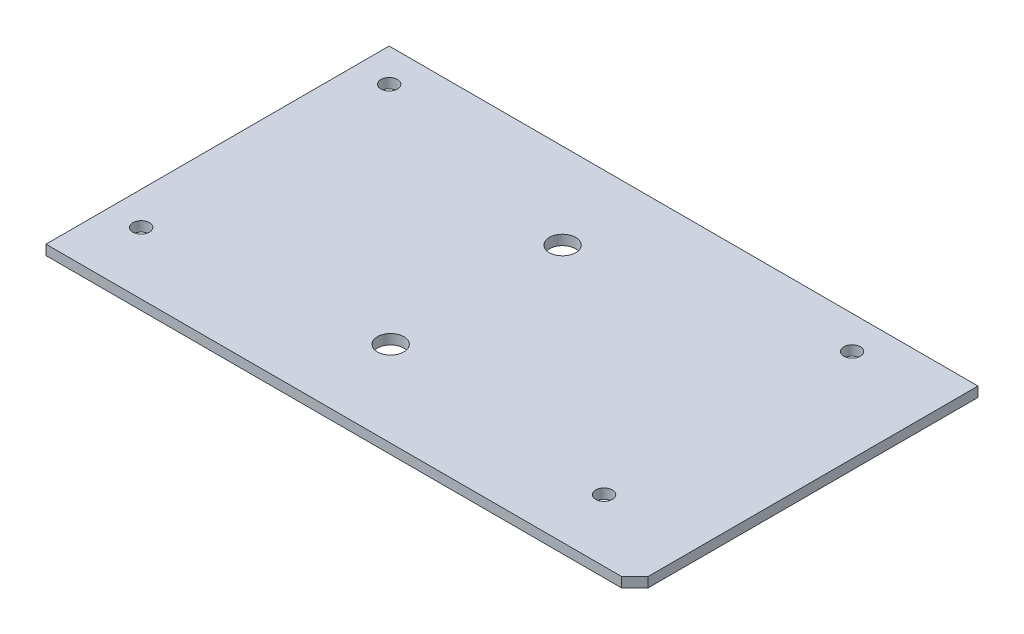
ISO-10303-21;
HEADER;
FILE_DESCRIPTION(('STEP AP214'),'2;1');
FILE_NAME('part.step','',(''),(''),'','','');
FILE_SCHEMA(('AUTOMOTIVE_DESIGN { 1 0 10303 214 1 1 1 1 }'));
ENDSEC;
DATA;
#1=APPLICATION_CONTEXT('core data for automotive mechanical design processes');
#2=APPLICATION_PROTOCOL_DEFINITION('international standard','automotive_design',2000,#1);
#3=PRODUCT_CONTEXT('',#1,'mechanical');
#4=PRODUCT('Part','Part','',(#3));
#5=PRODUCT_RELATED_PRODUCT_CATEGORY('part','',(#4));
#6=PRODUCT_DEFINITION_FORMATION('','',#4);
#7=PRODUCT_DEFINITION_CONTEXT('part definition',#1,'design');
#8=PRODUCT_DEFINITION('design','',#6,#7);
#9=PRODUCT_DEFINITION_SHAPE('','',#8);
#10=(LENGTH_UNIT() NAMED_UNIT(*) SI_UNIT(.MILLI.,.METRE.));
#11=(NAMED_UNIT(*) PLANE_ANGLE_UNIT() SI_UNIT($,.RADIAN.));
#12=(NAMED_UNIT(*) SI_UNIT($,.STERADIAN.) SOLID_ANGLE_UNIT());
#13=UNCERTAINTY_MEASURE_WITH_UNIT(LENGTH_MEASURE(1.E-05),#10,'distance_accuracy_value','');
#14=(GEOMETRIC_REPRESENTATION_CONTEXT(3) GLOBAL_UNCERTAINTY_ASSIGNED_CONTEXT((#13)) GLOBAL_UNIT_ASSIGNED_CONTEXT((#10,
#11,#12)) REPRESENTATION_CONTEXT('',''));
#15=CARTESIAN_POINT('',(0.,0.,0.));
#16=DIRECTION('',(0.,0.,1.));
#17=DIRECTION('',(1.,0.,0.));
#18=AXIS2_PLACEMENT_3D('',#15,#16,#17);
#19=CARTESIAN_POINT('',(0.,3.,0.));
#20=DIRECTION('',(0.,1.,0.));
#21=DIRECTION('',(0.,0.,1.));
#22=AXIS2_PLACEMENT_3D('',#19,#20,#21);
#23=PLANE('',#22);
#24=CARTESIAN_POINT('',(-1.66,3.,30.39));
#25=DIRECTION('',(0.,1.,0.));
#26=DIRECTION('',(0.,0.,1.));
#27=AXIS2_PLACEMENT_3D('',#24,#25,#26);
#28=CIRCLE('',#27,4.);
#29=CARTESIAN_POINT('',(-1.66,3.,34.39));
#30=VERTEX_POINT('',#29);
#31=EDGE_CURVE('E129',#30,#30,#28,.T.);
#32=ORIENTED_EDGE('',*,*,#31,.F.);
#33=EDGE_LOOP('',(#32));
#34=FACE_BOUND('',#33,.T.);
#35=CARTESIAN_POINT('',(-1.66,3.,-21.61));
#36=DIRECTION('',(0.,1.,0.));
#37=DIRECTION('',(0.,0.,1.));
#38=AXIS2_PLACEMENT_3D('',#35,#36,#37);
#39=CIRCLE('',#38,4.);
#40=CARTESIAN_POINT('',(-1.66,3.,-17.61));
#41=VERTEX_POINT('',#40);
#42=EDGE_CURVE('E120',#41,#41,#39,.T.);
#43=ORIENTED_EDGE('',*,*,#42,.F.);
#44=EDGE_LOOP('',(#43));
#45=FACE_BOUND('',#44,.T.);
#46=DIRECTION('',(-0.707106781186547,0.,0.707106781186547));
#47=VECTOR('',#46,1.);
#48=CARTESIAN_POINT('',(94.09,3.,56.28));
#49=LINE('',#48,#47);
#50=CARTESIAN_POINT('',(98.09,3.,52.28));
#51=VERTEX_POINT('',#50);
#52=CARTESIAN_POINT('',(94.09,3.,56.28));
#53=VERTEX_POINT('',#52);
#54=EDGE_CURVE('E92',#51,#53,#49,.T.);
#55=ORIENTED_EDGE('',*,*,#54,.F.);
#56=DIRECTION('',(0.,0.,-1.));
#57=VECTOR('',#56,1.);
#58=CARTESIAN_POINT('',(98.09,3.,56.28));
#59=LINE('',#58,#57);
#60=CARTESIAN_POINT('',(98.09,3.,-47.5));
#61=VERTEX_POINT('',#60);
#62=EDGE_CURVE('E158',#51,#61,#59,.T.);
#63=ORIENTED_EDGE('',*,*,#62,.T.);
#64=DIRECTION('',(-1.,0.,0.));
#65=VECTOR('',#64,1.);
#66=CARTESIAN_POINT('',(98.09,3.,-47.5));
#67=LINE('',#66,#65);
#68=CARTESIAN_POINT('',(-80.,3.,-47.5));
#69=VERTEX_POINT('',#68);
#70=EDGE_CURVE('E59',#61,#69,#67,.T.);
#71=ORIENTED_EDGE('',*,*,#70,.T.);
#72=DIRECTION('',(0.,0.,1.));
#73=VECTOR('',#72,1.);
#74=CARTESIAN_POINT('',(-80.,3.,-47.5));
#75=LINE('',#74,#73);
#76=CARTESIAN_POINT('',(-80.,3.,56.28));
#77=VERTEX_POINT('',#76);
#78=EDGE_CURVE('E80',#69,#77,#75,.T.);
#79=ORIENTED_EDGE('',*,*,#78,.T.);
#80=DIRECTION('',(1.,0.,0.));
#81=VECTOR('',#80,1.);
#82=CARTESIAN_POINT('',(-80.,3.,56.28));
#83=LINE('',#82,#81);
#84=EDGE_CURVE('E156',#77,#53,#83,.T.);
#85=ORIENTED_EDGE('',*,*,#84,.T.);
#86=EDGE_LOOP('',(#55,#63,#71,#79,#85));
#87=FACE_BOUND('',#86,.T.);
#88=CARTESIAN_POINT('',(70.,3.,-37.5));
#89=DIRECTION('',(0.,1.,0.));
#90=DIRECTION('',(0.,0.,1.));
#91=AXIS2_PLACEMENT_3D('',#88,#89,#90);
#92=CIRCLE('',#91,2.5);
#93=CARTESIAN_POINT('',(70.,3.,-35.));
#94=VERTEX_POINT('',#93);
#95=EDGE_CURVE('E139',#94,#94,#92,.T.);
#96=ORIENTED_EDGE('',*,*,#95,.F.);
#97=EDGE_LOOP('',(#96));
#98=FACE_BOUND('',#97,.T.);
#99=CARTESIAN_POINT('',(-70.,3.,37.5));
#100=DIRECTION('',(0.,1.,0.));
#101=DIRECTION('',(0.,0.,1.));
#102=AXIS2_PLACEMENT_3D('',#99,#100,#101);
#103=CIRCLE('',#102,2.5);
#104=CARTESIAN_POINT('',(-70.,3.,40.));
#105=VERTEX_POINT('',#104);
#106=EDGE_CURVE('E109',#105,#105,#103,.T.);
#107=ORIENTED_EDGE('',*,*,#106,.F.);
#108=EDGE_LOOP('',(#107));
#109=FACE_BOUND('',#108,.T.);
#110=CARTESIAN_POINT('',(-70.,3.,-37.5));
#111=DIRECTION('',(0.,1.,0.));
#112=DIRECTION('',(0.,0.,1.));
#113=AXIS2_PLACEMENT_3D('',#110,#111,#112);
#114=CIRCLE('',#113,2.5);
#115=CARTESIAN_POINT('',(-70.,3.,-35.));
#116=VERTEX_POINT('',#115);
#117=EDGE_CURVE('E145',#116,#116,#114,.T.);
#118=ORIENTED_EDGE('',*,*,#117,.F.);
#119=EDGE_LOOP('',(#118));
#120=FACE_BOUND('',#119,.T.);
#121=CARTESIAN_POINT('',(70.,3.,37.5));
#122=DIRECTION('',(0.,1.,0.));
#123=DIRECTION('',(0.,0.,1.));
#124=AXIS2_PLACEMENT_3D('',#121,#122,#123);
#125=CIRCLE('',#124,2.5);
#126=CARTESIAN_POINT('',(70.,3.,40.));
#127=VERTEX_POINT('',#126);
#128=EDGE_CURVE('E133',#127,#127,#125,.T.);
#129=ORIENTED_EDGE('',*,*,#128,.F.);
#130=EDGE_LOOP('',(#129));
#131=FACE_BOUND('',#130,.T.);
#132=ADVANCED_FACE('F33',(#34,#45,#87,#98,#109,#120,#131),#23,.T.);
#133=CARTESIAN_POINT('',(0.,0.,0.));
#134=DIRECTION('',(0.,1.,0.));
#135=DIRECTION('',(0.,0.,1.));
#136=AXIS2_PLACEMENT_3D('',#133,#134,#135);
#137=PLANE('',#136);
#138=CARTESIAN_POINT('',(-1.66,0.,30.39));
#139=DIRECTION('',(0.,1.,0.));
#140=DIRECTION('',(0.,0.,1.));
#141=AXIS2_PLACEMENT_3D('',#138,#139,#140);
#142=CIRCLE('',#141,4.);
#143=CARTESIAN_POINT('',(-1.66,0.,34.39));
#144=VERTEX_POINT('',#143);
#145=EDGE_CURVE('E37',#144,#144,#142,.T.);
#146=ORIENTED_EDGE('',*,*,#145,.T.);
#147=EDGE_LOOP('',(#146));
#148=FACE_BOUND('',#147,.T.);
#149=CARTESIAN_POINT('',(-1.66,0.,-21.61));
#150=DIRECTION('',(0.,1.,0.));
#151=DIRECTION('',(0.,0.,1.));
#152=AXIS2_PLACEMENT_3D('',#149,#150,#151);
#153=CIRCLE('',#152,4.);
#154=CARTESIAN_POINT('',(-1.66,0.,-17.61));
#155=VERTEX_POINT('',#154);
#156=EDGE_CURVE('E118',#155,#155,#153,.T.);
#157=ORIENTED_EDGE('',*,*,#156,.T.);
#158=EDGE_LOOP('',(#157));
#159=FACE_BOUND('',#158,.T.);
#160=DIRECTION('',(0.,0.,-1.));
#161=VECTOR('',#160,1.);
#162=CARTESIAN_POINT('',(98.09,0.,56.28));
#163=LINE('',#162,#161);
#164=CARTESIAN_POINT('',(98.09,0.,52.28));
#165=VERTEX_POINT('',#164);
#166=CARTESIAN_POINT('',(98.09,0.,-47.5));
#167=VERTEX_POINT('',#166);
#168=EDGE_CURVE('E103',#165,#167,#163,.T.);
#169=ORIENTED_EDGE('',*,*,#168,.F.);
#170=DIRECTION('',(-0.707106781186547,0.,0.707106781186547));
#171=VECTOR('',#170,1.);
#172=CARTESIAN_POINT('',(94.09,0.,56.28));
#173=LINE('',#172,#171);
#174=CARTESIAN_POINT('',(94.09,0.,56.28));
#175=VERTEX_POINT('',#174);
#176=EDGE_CURVE('E50',#165,#175,#173,.T.);
#177=ORIENTED_EDGE('',*,*,#176,.T.);
#178=DIRECTION('',(1.,0.,0.));
#179=VECTOR('',#178,1.);
#180=CARTESIAN_POINT('',(-80.,0.,56.28));
#181=LINE('',#180,#179);
#182=CARTESIAN_POINT('',(-80.,0.,56.28));
#183=VERTEX_POINT('',#182);
#184=EDGE_CURVE('E102',#183,#175,#181,.T.);
#185=ORIENTED_EDGE('',*,*,#184,.F.);
#186=DIRECTION('',(0.,0.,1.));
#187=VECTOR('',#186,1.);
#188=CARTESIAN_POINT('',(-80.,0.,37.5));
#189=LINE('',#188,#187);
#190=CARTESIAN_POINT('',(-80.,0.,-47.5));
#191=VERTEX_POINT('',#190);
#192=EDGE_CURVE('E76',#191,#183,#189,.T.);
#193=ORIENTED_EDGE('',*,*,#192,.F.);
#194=DIRECTION('',(-1.,0.,0.));
#195=VECTOR('',#194,1.);
#196=CARTESIAN_POINT('',(98.09,0.,-47.5));
#197=LINE('',#196,#195);
#198=EDGE_CURVE('E107',#167,#191,#197,.T.);
#199=ORIENTED_EDGE('',*,*,#198,.F.);
#200=EDGE_LOOP('',(#169,#177,#185,#193,#199));
#201=FACE_BOUND('',#200,.T.);
#202=CARTESIAN_POINT('',(-70.,0.,37.5));
#203=DIRECTION('',(0.,1.,0.));
#204=DIRECTION('',(0.,0.,1.));
#205=AXIS2_PLACEMENT_3D('',#202,#203,#204);
#206=CIRCLE('',#205,2.5);
#207=CARTESIAN_POINT('',(-70.,0.,40.));
#208=VERTEX_POINT('',#207);
#209=EDGE_CURVE('E148',#208,#208,#206,.T.);
#210=ORIENTED_EDGE('',*,*,#209,.T.);
#211=EDGE_LOOP('',(#210));
#212=FACE_BOUND('',#211,.T.);
#213=CARTESIAN_POINT('',(-70.,0.,-37.5));
#214=DIRECTION('',(0.,1.,0.));
#215=DIRECTION('',(0.,0.,1.));
#216=AXIS2_PLACEMENT_3D('',#213,#214,#215);
#217=CIRCLE('',#216,2.5);
#218=CARTESIAN_POINT('',(-70.,0.,-35.));
#219=VERTEX_POINT('',#218);
#220=EDGE_CURVE('E142',#219,#219,#217,.T.);
#221=ORIENTED_EDGE('',*,*,#220,.T.);
#222=EDGE_LOOP('',(#221));
#223=FACE_BOUND('',#222,.T.);
#224=CARTESIAN_POINT('',(70.,0.,-37.5));
#225=DIRECTION('',(0.,1.,0.));
#226=DIRECTION('',(0.,0.,1.));
#227=AXIS2_PLACEMENT_3D('',#224,#225,#226);
#228=CIRCLE('',#227,2.5);
#229=CARTESIAN_POINT('',(70.,0.,-35.));
#230=VERTEX_POINT('',#229);
#231=EDGE_CURVE('E136',#230,#230,#228,.T.);
#232=ORIENTED_EDGE('',*,*,#231,.T.);
#233=EDGE_LOOP('',(#232));
#234=FACE_BOUND('',#233,.T.);
#235=CARTESIAN_POINT('',(70.,0.,37.5));
#236=DIRECTION('',(0.,1.,0.));
#237=DIRECTION('',(0.,0.,1.));
#238=AXIS2_PLACEMENT_3D('',#235,#236,#237);
#239=CIRCLE('',#238,2.5);
#240=CARTESIAN_POINT('',(70.,0.,40.));
#241=VERTEX_POINT('',#240);
#242=EDGE_CURVE('E96',#241,#241,#239,.T.);
#243=ORIENTED_EDGE('',*,*,#242,.T.);
#244=EDGE_LOOP('',(#243));
#245=FACE_BOUND('',#244,.T.);
#246=ADVANCED_FACE('F100',(#148,#159,#201,#212,#223,#234,#245),#137,.F.);
#247=CARTESIAN_POINT('',(-80.,3.,37.5));
#248=DIRECTION('',(1.,0.,0.));
#249=DIRECTION('',(0.,0.,-1.));
#250=AXIS2_PLACEMENT_3D('',#247,#248,#249);
#251=PLANE('',#250);
#252=ORIENTED_EDGE('',*,*,#192,.T.);
#253=DIRECTION('',(0.,-1.,0.));
#254=VECTOR('',#253,1.);
#255=CARTESIAN_POINT('',(-80.,3.,56.28));
#256=LINE('',#255,#254);
#257=EDGE_CURVE('E11',#77,#183,#256,.T.);
#258=ORIENTED_EDGE('',*,*,#257,.F.);
#259=ORIENTED_EDGE('',*,*,#78,.F.);
#260=DIRECTION('',(0.,-1.,0.));
#261=VECTOR('',#260,1.);
#262=CARTESIAN_POINT('',(-80.,3.,-47.5));
#263=LINE('',#262,#261);
#264=EDGE_CURVE('E114',#69,#191,#263,.T.);
#265=ORIENTED_EDGE('',*,*,#264,.T.);
#266=EDGE_LOOP('',(#252,#258,#259,#265));
#267=FACE_BOUND('',#266,.T.);
#268=ADVANCED_FACE('F35',(#267),#251,.F.);
#269=CARTESIAN_POINT('',(-80.,3.,56.28));
#270=DIRECTION('',(0.,0.,-1.));
#271=DIRECTION('',(-1.,0.,0.));
#272=AXIS2_PLACEMENT_3D('',#269,#270,#271);
#273=PLANE('',#272);
#274=ORIENTED_EDGE('',*,*,#184,.T.);
#275=DIRECTION('',(0.,1.,0.));
#276=VECTOR('',#275,1.);
#277=CARTESIAN_POINT('',(94.09,0.,56.28));
#278=LINE('',#277,#276);
#279=EDGE_CURVE('E89',#175,#53,#278,.T.);
#280=ORIENTED_EDGE('',*,*,#279,.T.);
#281=ORIENTED_EDGE('',*,*,#84,.F.);
#282=ORIENTED_EDGE('',*,*,#257,.T.);
#283=EDGE_LOOP('',(#274,#280,#281,#282));
#284=FACE_BOUND('',#283,.T.);
#285=ADVANCED_FACE('F105',(#284),#273,.F.);
#286=CARTESIAN_POINT('',(98.09,3.,56.28));
#287=DIRECTION('',(-1.,0.,0.));
#288=DIRECTION('',(0.,0.,1.));
#289=AXIS2_PLACEMENT_3D('',#286,#287,#288);
#290=PLANE('',#289);
#291=ORIENTED_EDGE('',*,*,#62,.F.);
#292=DIRECTION('',(0.,1.,0.));
#293=VECTOR('',#292,1.);
#294=CARTESIAN_POINT('',(98.09,0.,52.28));
#295=LINE('',#294,#293);
#296=EDGE_CURVE('E97',#165,#51,#295,.T.);
#297=ORIENTED_EDGE('',*,*,#296,.F.);
#298=ORIENTED_EDGE('',*,*,#168,.T.);
#299=DIRECTION('',(0.,-1.,0.));
#300=VECTOR('',#299,1.);
#301=CARTESIAN_POINT('',(98.09,3.,-47.5));
#302=LINE('',#301,#300);
#303=EDGE_CURVE('E42',#61,#167,#302,.T.);
#304=ORIENTED_EDGE('',*,*,#303,.F.);
#305=EDGE_LOOP('',(#291,#297,#298,#304));
#306=FACE_BOUND('',#305,.T.);
#307=ADVANCED_FACE('F163',(#306),#290,.F.);
#308=CARTESIAN_POINT('',(98.09,3.,-47.5));
#309=DIRECTION('',(0.,0.,1.));
#310=DIRECTION('',(1.,0.,0.));
#311=AXIS2_PLACEMENT_3D('',#308,#309,#310);
#312=PLANE('',#311);
#313=ORIENTED_EDGE('',*,*,#198,.T.);
#314=ORIENTED_EDGE('',*,*,#264,.F.);
#315=ORIENTED_EDGE('',*,*,#70,.F.);
#316=ORIENTED_EDGE('',*,*,#303,.T.);
#317=EDGE_LOOP('',(#313,#314,#315,#316));
#318=FACE_BOUND('',#317,.T.);
#319=ADVANCED_FACE('F165',(#318),#312,.F.);
#320=CARTESIAN_POINT('',(-70.,3.,37.5));
#321=DIRECTION('',(0.,-1.,0.));
#322=DIRECTION('',(0.,0.,-1.));
#323=AXIS2_PLACEMENT_3D('',#320,#321,#322);
#324=CYLINDRICAL_SURFACE('',#323,2.5);
#325=ORIENTED_EDGE('',*,*,#106,.T.);
#326=EDGE_LOOP('',(#325));
#327=FACE_BOUND('',#326,.T.);
#328=ORIENTED_EDGE('',*,*,#209,.F.);
#329=EDGE_LOOP('',(#328));
#330=FACE_BOUND('',#329,.T.);
#331=ADVANCED_FACE('F182',(#327,#330),#324,.F.);
#332=CARTESIAN_POINT('',(-70.,3.,-37.5));
#333=DIRECTION('',(0.,-1.,0.));
#334=DIRECTION('',(0.,0.,-1.));
#335=AXIS2_PLACEMENT_3D('',#332,#333,#334);
#336=CYLINDRICAL_SURFACE('',#335,2.5);
#337=ORIENTED_EDGE('',*,*,#117,.T.);
#338=EDGE_LOOP('',(#337));
#339=FACE_BOUND('',#338,.T.);
#340=ORIENTED_EDGE('',*,*,#220,.F.);
#341=EDGE_LOOP('',(#340));
#342=FACE_BOUND('',#341,.T.);
#343=ADVANCED_FACE('F203',(#339,#342),#336,.F.);
#344=CARTESIAN_POINT('',(70.,3.,-37.5));
#345=DIRECTION('',(0.,-1.,0.));
#346=DIRECTION('',(0.,0.,-1.));
#347=AXIS2_PLACEMENT_3D('',#344,#345,#346);
#348=CYLINDRICAL_SURFACE('',#347,2.5);
#349=ORIENTED_EDGE('',*,*,#95,.T.);
#350=EDGE_LOOP('',(#349));
#351=FACE_BOUND('',#350,.T.);
#352=ORIENTED_EDGE('',*,*,#231,.F.);
#353=EDGE_LOOP('',(#352));
#354=FACE_BOUND('',#353,.T.);
#355=ADVANCED_FACE('F210',(#351,#354),#348,.F.);
#356=CARTESIAN_POINT('',(70.,3.,37.5));
#357=DIRECTION('',(0.,-1.,0.));
#358=DIRECTION('',(0.,0.,-1.));
#359=AXIS2_PLACEMENT_3D('',#356,#357,#358);
#360=CYLINDRICAL_SURFACE('',#359,2.5);
#361=ORIENTED_EDGE('',*,*,#128,.T.);
#362=EDGE_LOOP('',(#361));
#363=FACE_BOUND('',#362,.T.);
#364=ORIENTED_EDGE('',*,*,#242,.F.);
#365=EDGE_LOOP('',(#364));
#366=FACE_BOUND('',#365,.T.);
#367=ADVANCED_FACE('F217',(#363,#366),#360,.F.);
#368=CARTESIAN_POINT('',(94.09,0.,56.28));
#369=DIRECTION('',(-0.707106781186548,0.,-0.707106781186548));
#370=DIRECTION('',(-0.707106781186548,0.,0.707106781186548));
#371=AXIS2_PLACEMENT_3D('',#368,#369,#370);
#372=PLANE('',#371);
#373=ORIENTED_EDGE('',*,*,#54,.T.);
#374=ORIENTED_EDGE('',*,*,#279,.F.);
#375=ORIENTED_EDGE('',*,*,#176,.F.);
#376=ORIENTED_EDGE('',*,*,#296,.T.);
#377=EDGE_LOOP('',(#373,#374,#375,#376));
#378=FACE_BOUND('',#377,.T.);
#379=ADVANCED_FACE('F90',(#378),#372,.F.);
#380=CARTESIAN_POINT('',(-1.66,-2.,-21.61));
#381=DIRECTION('',(0.,1.,0.));
#382=DIRECTION('',(0.,0.,1.));
#383=AXIS2_PLACEMENT_3D('',#380,#381,#382);
#384=CYLINDRICAL_SURFACE('',#383,4.);
#385=ORIENTED_EDGE('',*,*,#42,.T.);
#386=EDGE_LOOP('',(#385));
#387=FACE_BOUND('',#386,.T.);
#388=ORIENTED_EDGE('',*,*,#156,.F.);
#389=EDGE_LOOP('',(#388));
#390=FACE_BOUND('',#389,.T.);
#391=ADVANCED_FACE('F231',(#387,#390),#384,.F.);
#392=CARTESIAN_POINT('',(-1.66,-2.,30.39));
#393=DIRECTION('',(0.,1.,0.));
#394=DIRECTION('',(0.,0.,1.));
#395=AXIS2_PLACEMENT_3D('',#392,#393,#394);
#396=CYLINDRICAL_SURFACE('',#395,4.);
#397=ORIENTED_EDGE('',*,*,#31,.T.);
#398=EDGE_LOOP('',(#397));
#399=FACE_BOUND('',#398,.T.);
#400=ORIENTED_EDGE('',*,*,#145,.F.);
#401=EDGE_LOOP('',(#400));
#402=FACE_BOUND('',#401,.T.);
#403=ADVANCED_FACE('F238',(#399,#402),#396,.F.);
#404=CLOSED_SHELL('',(#132,#246,#268,#285,#307,#319,#331,#343,#355,#367,#379,#391,#403));
#405=MANIFOLD_SOLID_BREP('B2',#404);
#406=ADVANCED_BREP_SHAPE_REPRESENTATION('',(#18,#405),#14);
#407=SHAPE_DEFINITION_REPRESENTATION(#9,#406);
ENDSEC;
END-ISO-10303-21;
